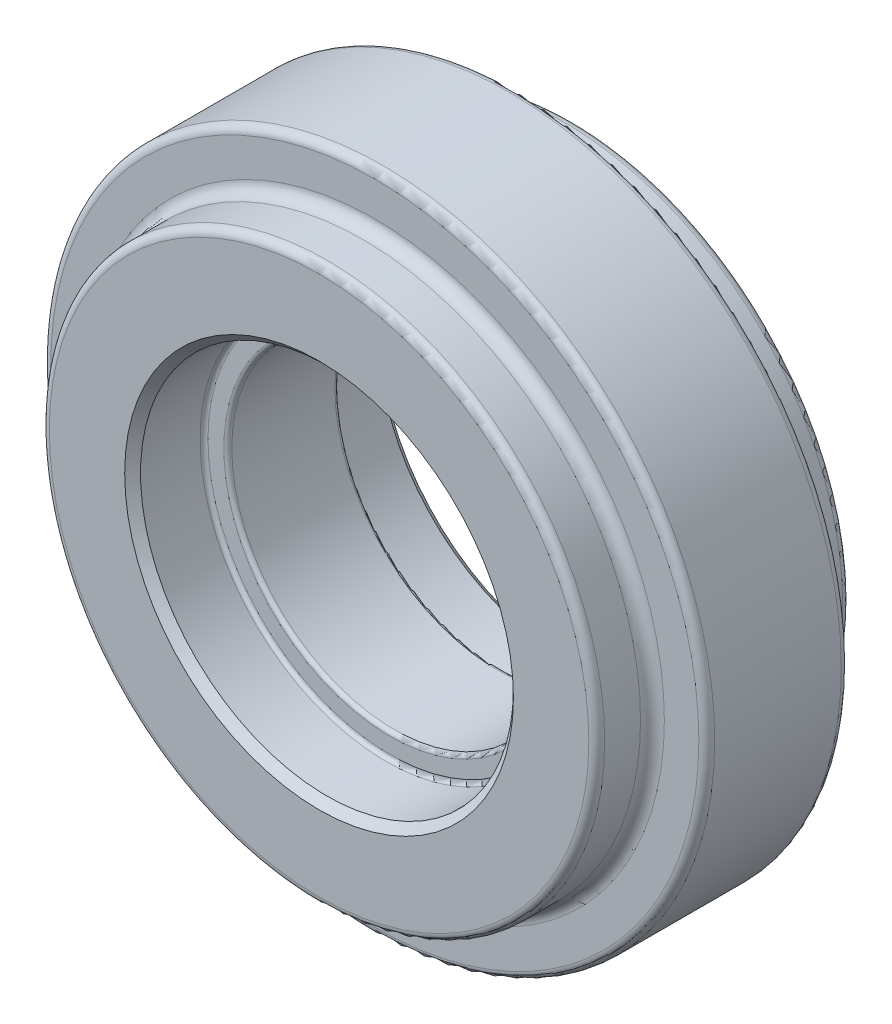
ISO-10303-21;
HEADER;
FILE_DESCRIPTION(('STEP AP214'),'2;1');
FILE_NAME('part.step','',(''),(''),'','','');
FILE_SCHEMA(('AUTOMOTIVE_DESIGN { 1 0 10303 214 1 1 1 1 }'));
ENDSEC;
DATA;
#1=APPLICATION_CONTEXT('core data for automotive mechanical design processes');
#2=APPLICATION_PROTOCOL_DEFINITION('international standard','automotive_design',2000,#1);
#3=PRODUCT_CONTEXT('',#1,'mechanical');
#4=PRODUCT('Part','Part','',(#3));
#5=PRODUCT_RELATED_PRODUCT_CATEGORY('part','',(#4));
#6=PRODUCT_DEFINITION_FORMATION('','',#4);
#7=PRODUCT_DEFINITION_CONTEXT('part definition',#1,'design');
#8=PRODUCT_DEFINITION('design','',#6,#7);
#9=PRODUCT_DEFINITION_SHAPE('','',#8);
#10=(LENGTH_UNIT() NAMED_UNIT(*) SI_UNIT(.MILLI.,.METRE.));
#11=(NAMED_UNIT(*) PLANE_ANGLE_UNIT() SI_UNIT($,.RADIAN.));
#12=(NAMED_UNIT(*) SI_UNIT($,.STERADIAN.) SOLID_ANGLE_UNIT());
#13=UNCERTAINTY_MEASURE_WITH_UNIT(LENGTH_MEASURE(1.E-05),#10,'distance_accuracy_value','');
#14=(GEOMETRIC_REPRESENTATION_CONTEXT(3) GLOBAL_UNCERTAINTY_ASSIGNED_CONTEXT((#13)) GLOBAL_UNIT_ASSIGNED_CONTEXT((#10,
#11,#12)) REPRESENTATION_CONTEXT('',''));
#15=CARTESIAN_POINT('',(0.,0.,0.));
#16=DIRECTION('',(0.,0.,1.));
#17=DIRECTION('',(1.,0.,0.));
#18=AXIS2_PLACEMENT_3D('',#15,#16,#17);
#19=CARTESIAN_POINT('',(0.,0.,17.955));
#20=DIRECTION('',(0.,0.,-1.));
#21=DIRECTION('',(-1.,0.,0.));
#22=AXIS2_PLACEMENT_3D('',#19,#20,#21);
#23=CYLINDRICAL_SURFACE('',#22,41.84762);
#24=CARTESIAN_POINT('',(0.,0.,1.));
#25=DIRECTION('',(0.,0.,1.));
#26=DIRECTION('',(1.,0.,0.));
#27=AXIS2_PLACEMENT_3D('',#24,#25,#26);
#28=CIRCLE('',#27,41.84762);
#29=CARTESIAN_POINT('',(41.84762,0.,1.));
#30=VERTEX_POINT('',#29);
#31=EDGE_CURVE('E88',#30,#30,#28,.T.);
#32=ORIENTED_EDGE('',*,*,#31,.T.);
#33=EDGE_LOOP('',(#32));
#34=FACE_BOUND('',#33,.T.);
#35=CARTESIAN_POINT('',(0.,0.,16.955));
#36=DIRECTION('',(0.,0.,1.));
#37=DIRECTION('',(1.,0.,0.));
#38=AXIS2_PLACEMENT_3D('',#35,#36,#37);
#39=CIRCLE('',#38,41.84762);
#40=CARTESIAN_POINT('',(41.84762,0.,16.955));
#41=VERTEX_POINT('',#40);
#42=EDGE_CURVE('E91',#41,#41,#39,.F.);
#43=ORIENTED_EDGE('',*,*,#42,.T.);
#44=EDGE_LOOP('',(#43));
#45=FACE_BOUND('',#44,.T.);
#46=ADVANCED_FACE('F32',(#34,#45),#23,.T.);
#47=CARTESIAN_POINT('',(0.,0.,17.955));
#48=DIRECTION('',(0.,0.,1.));
#49=DIRECTION('',(1.,0.,0.));
#50=AXIS2_PLACEMENT_3D('',#47,#48,#49);
#51=PLANE('',#50);
#52=CARTESIAN_POINT('',(0.,0.,17.955));
#53=DIRECTION('',(0.,0.,1.));
#54=DIRECTION('',(1.,0.,0.));
#55=AXIS2_PLACEMENT_3D('',#52,#53,#54);
#56=CIRCLE('',#55,40.84762);
#57=CARTESIAN_POINT('',(40.84762,0.,17.955));
#58=VERTEX_POINT('',#57);
#59=EDGE_CURVE('E82',#58,#58,#56,.T.);
#60=ORIENTED_EDGE('',*,*,#59,.T.);
#61=EDGE_LOOP('',(#60));
#62=FACE_BOUND('',#61,.T.);
#63=CARTESIAN_POINT('',(0.,0.,17.955));
#64=DIRECTION('',(0.,0.,1.));
#65=DIRECTION('',(1.,0.,0.));
#66=AXIS2_PLACEMENT_3D('',#63,#64,#65);
#67=CIRCLE('',#66,36.5);
#68=CARTESIAN_POINT('',(36.5,0.,17.955));
#69=VERTEX_POINT('',#68);
#70=EDGE_CURVE('E100',#69,#69,#67,.F.);
#71=ORIENTED_EDGE('',*,*,#70,.T.);
#72=EDGE_LOOP('',(#71));
#73=FACE_BOUND('',#72,.T.);
#74=ADVANCED_FACE('F132',(#62,#73),#51,.T.);
#75=CARTESIAN_POINT('',(0.,0.,0.));
#76=DIRECTION('',(0.,0.,1.));
#77=DIRECTION('',(1.,0.,0.));
#78=AXIS2_PLACEMENT_3D('',#75,#76,#77);
#79=PLANE('',#78);
#80=CARTESIAN_POINT('',(0.,0.,0.));
#81=DIRECTION('',(0.,0.,1.));
#82=DIRECTION('',(1.,0.,0.));
#83=AXIS2_PLACEMENT_3D('',#80,#81,#82);
#84=CIRCLE('',#83,40.84762);
#85=CARTESIAN_POINT('',(40.84762,0.,0.));
#86=VERTEX_POINT('',#85);
#87=EDGE_CURVE('E85',#86,#86,#84,.F.);
#88=ORIENTED_EDGE('',*,*,#87,.T.);
#89=EDGE_LOOP('',(#88));
#90=FACE_BOUND('',#89,.T.);
#91=CARTESIAN_POINT('',(0.,0.,0.));
#92=DIRECTION('',(0.,0.,1.));
#93=DIRECTION('',(1.,0.,0.));
#94=AXIS2_PLACEMENT_3D('',#91,#92,#93);
#95=CIRCLE('',#94,36.5);
#96=CARTESIAN_POINT('',(36.5,0.,0.));
#97=VERTEX_POINT('',#96);
#98=EDGE_CURVE('E106',#97,#97,#95,.T.);
#99=ORIENTED_EDGE('',*,*,#98,.T.);
#100=EDGE_LOOP('',(#99));
#101=FACE_BOUND('',#100,.T.);
#102=ADVANCED_FACE('F137',(#90,#101),#79,.F.);
#103=CARTESIAN_POINT('',(0.,0.,24.9775));
#104=DIRECTION('',(0.,0.,-1.));
#105=DIRECTION('',(-1.,0.,0.));
#106=AXIS2_PLACEMENT_3D('',#103,#104,#105);
#107=CYLINDRICAL_SURFACE('',#106,35.);
#108=CARTESIAN_POINT('',(0.,0.,23.9775));
#109=DIRECTION('',(0.,0.,1.));
#110=DIRECTION('',(1.,0.,0.));
#111=AXIS2_PLACEMENT_3D('',#108,#109,#110);
#112=CIRCLE('',#111,35.);
#113=CARTESIAN_POINT('',(35.,0.,23.9775));
#114=VERTEX_POINT('',#113);
#115=EDGE_CURVE('E76',#114,#114,#112,.F.);
#116=ORIENTED_EDGE('',*,*,#115,.T.);
#117=EDGE_LOOP('',(#116));
#118=FACE_BOUND('',#117,.T.);
#119=CARTESIAN_POINT('',(0.,0.,19.455));
#120=DIRECTION('',(0.,0.,1.));
#121=DIRECTION('',(1.,0.,0.));
#122=AXIS2_PLACEMENT_3D('',#119,#120,#121);
#123=CIRCLE('',#122,35.);
#124=CARTESIAN_POINT('',(35.,0.,19.455));
#125=VERTEX_POINT('',#124);
#126=EDGE_CURVE('E103',#125,#125,#123,.T.);
#127=ORIENTED_EDGE('',*,*,#126,.T.);
#128=EDGE_LOOP('',(#127));
#129=FACE_BOUND('',#128,.T.);
#130=ADVANCED_FACE('F143',(#118,#129),#107,.T.);
#131=CARTESIAN_POINT('',(0.,0.,24.9775));
#132=DIRECTION('',(0.,0.,1.));
#133=DIRECTION('',(1.,0.,0.));
#134=AXIS2_PLACEMENT_3D('',#131,#132,#133);
#135=PLANE('',#134);
#136=CARTESIAN_POINT('',(0.,0.,24.9775));
#137=DIRECTION('',(0.,0.,1.));
#138=DIRECTION('',(1.,0.,0.));
#139=AXIS2_PLACEMENT_3D('',#136,#137,#138);
#140=CIRCLE('',#139,24.5);
#141=CARTESIAN_POINT('',(24.5,0.,24.9775));
#142=VERTEX_POINT('',#141);
#143=EDGE_CURVE('E43',#142,#142,#140,.F.);
#144=ORIENTED_EDGE('',*,*,#143,.T.);
#145=EDGE_LOOP('',(#144));
#146=FACE_BOUND('',#145,.T.);
#147=CARTESIAN_POINT('',(0.,0.,24.9775));
#148=DIRECTION('',(0.,0.,1.));
#149=DIRECTION('',(1.,0.,0.));
#150=AXIS2_PLACEMENT_3D('',#147,#148,#149);
#151=CIRCLE('',#150,34.);
#152=CARTESIAN_POINT('',(34.,0.,24.9775));
#153=VERTEX_POINT('',#152);
#154=EDGE_CURVE('E79',#153,#153,#151,.T.);
#155=ORIENTED_EDGE('',*,*,#154,.T.);
#156=EDGE_LOOP('',(#155));
#157=FACE_BOUND('',#156,.T.);
#158=ADVANCED_FACE('F148',(#146,#157),#135,.T.);
#159=CARTESIAN_POINT('',(0.,0.,-7.0225));
#160=DIRECTION('',(0.,0.,1.));
#161=DIRECTION('',(1.,0.,0.));
#162=AXIS2_PLACEMENT_3D('',#159,#160,#161);
#163=CYLINDRICAL_SURFACE('',#162,35.);
#164=CARTESIAN_POINT('',(0.,0.,-6.0225));
#165=DIRECTION('',(0.,0.,-1.));
#166=DIRECTION('',(-1.,0.,0.));
#167=AXIS2_PLACEMENT_3D('',#164,#165,#166);
#168=CIRCLE('',#167,35.);
#169=CARTESIAN_POINT('',(-35.,0.,-6.0225));
#170=VERTEX_POINT('',#169);
#171=EDGE_CURVE('E94',#170,#170,#168,.F.);
#172=ORIENTED_EDGE('',*,*,#171,.T.);
#173=EDGE_LOOP('',(#172));
#174=FACE_BOUND('',#173,.T.);
#175=CARTESIAN_POINT('',(0.,0.,-1.5));
#176=DIRECTION('',(0.,0.,1.));
#177=DIRECTION('',(1.,0.,0.));
#178=AXIS2_PLACEMENT_3D('',#175,#176,#177);
#179=CIRCLE('',#178,35.);
#180=CARTESIAN_POINT('',(35.,0.,-1.5));
#181=VERTEX_POINT('',#180);
#182=EDGE_CURVE('E109',#181,#181,#179,.F.);
#183=ORIENTED_EDGE('',*,*,#182,.T.);
#184=EDGE_LOOP('',(#183));
#185=FACE_BOUND('',#184,.T.);
#186=ADVANCED_FACE('F113',(#174,#185),#163,.T.);
#187=CARTESIAN_POINT('',(0.,0.,-7.0225));
#188=DIRECTION('',(0.,0.,-1.));
#189=DIRECTION('',(-1.,0.,0.));
#190=AXIS2_PLACEMENT_3D('',#187,#188,#189);
#191=PLANE('',#190);
#192=CARTESIAN_POINT('',(0.,0.,-7.0225));
#193=DIRECTION('',(0.,0.,-1.));
#194=DIRECTION('',(-1.,0.,0.));
#195=AXIS2_PLACEMENT_3D('',#192,#193,#194);
#196=CIRCLE('',#195,24.5);
#197=CARTESIAN_POINT('',(-24.5,0.,-7.0225));
#198=VERTEX_POINT('',#197);
#199=EDGE_CURVE('E10',#198,#198,#196,.F.);
#200=ORIENTED_EDGE('',*,*,#199,.T.);
#201=EDGE_LOOP('',(#200));
#202=FACE_BOUND('',#201,.T.);
#203=CARTESIAN_POINT('',(0.,0.,-7.0225));
#204=DIRECTION('',(0.,0.,-1.));
#205=DIRECTION('',(-1.,0.,0.));
#206=AXIS2_PLACEMENT_3D('',#203,#204,#205);
#207=CIRCLE('',#206,34.);
#208=CARTESIAN_POINT('',(-34.,0.,-7.0225));
#209=VERTEX_POINT('',#208);
#210=EDGE_CURVE('E97',#209,#209,#207,.T.);
#211=ORIENTED_EDGE('',*,*,#210,.T.);
#212=EDGE_LOOP('',(#211));
#213=FACE_BOUND('',#212,.T.);
#214=ADVANCED_FACE('F118',(#202,#213),#191,.T.);
#215=CARTESIAN_POINT('',(0.,0.,-1.5));
#216=DIRECTION('',(0.,0.,1.));
#217=DIRECTION('',(1.,0.,0.));
#218=AXIS2_PLACEMENT_3D('',#215,#216,#217);
#219=TOROIDAL_SURFACE('',#218,36.5,1.5);
#220=ORIENTED_EDGE('',*,*,#98,.F.);
#221=EDGE_LOOP('',(#220));
#222=FACE_BOUND('',#221,.T.);
#223=ORIENTED_EDGE('',*,*,#182,.F.);
#224=EDGE_LOOP('',(#223));
#225=FACE_BOUND('',#224,.T.);
#226=ADVANCED_FACE('F115',(#222,#225),#219,.F.);
#227=CARTESIAN_POINT('',(0.,0.,19.455));
#228=DIRECTION('',(0.,0.,1.));
#229=DIRECTION('',(1.,0.,0.));
#230=AXIS2_PLACEMENT_3D('',#227,#228,#229);
#231=TOROIDAL_SURFACE('',#230,36.5,1.5);
#232=ORIENTED_EDGE('',*,*,#70,.F.);
#233=EDGE_LOOP('',(#232));
#234=FACE_BOUND('',#233,.T.);
#235=ORIENTED_EDGE('',*,*,#126,.F.);
#236=EDGE_LOOP('',(#235));
#237=FACE_BOUND('',#236,.T.);
#238=ADVANCED_FACE('F117',(#234,#237),#231,.F.);
#239=CARTESIAN_POINT('',(0.,0.,-6.0225));
#240=DIRECTION('',(0.,0.,-1.));
#241=DIRECTION('',(-1.,0.,0.));
#242=AXIS2_PLACEMENT_3D('',#239,#240,#241);
#243=TOROIDAL_SURFACE('',#242,34.,1.);
#244=ORIENTED_EDGE('',*,*,#171,.F.);
#245=EDGE_LOOP('',(#244));
#246=FACE_BOUND('',#245,.T.);
#247=ORIENTED_EDGE('',*,*,#210,.F.);
#248=EDGE_LOOP('',(#247));
#249=FACE_BOUND('',#248,.T.);
#250=ADVANCED_FACE('F125',(#246,#249),#243,.T.);
#251=CARTESIAN_POINT('',(0.,0.,1.));
#252=DIRECTION('',(0.,0.,1.));
#253=DIRECTION('',(1.,0.,0.));
#254=AXIS2_PLACEMENT_3D('',#251,#252,#253);
#255=TOROIDAL_SURFACE('',#254,40.84762,1.);
#256=ORIENTED_EDGE('',*,*,#87,.F.);
#257=EDGE_LOOP('',(#256));
#258=FACE_BOUND('',#257,.T.);
#259=ORIENTED_EDGE('',*,*,#31,.F.);
#260=EDGE_LOOP('',(#259));
#261=FACE_BOUND('',#260,.T.);
#262=ADVANCED_FACE('F214',(#258,#261),#255,.T.);
#263=CARTESIAN_POINT('',(0.,0.,16.955));
#264=DIRECTION('',(0.,0.,1.));
#265=DIRECTION('',(1.,0.,0.));
#266=AXIS2_PLACEMENT_3D('',#263,#264,#265);
#267=TOROIDAL_SURFACE('',#266,40.84762,1.);
#268=ORIENTED_EDGE('',*,*,#42,.F.);
#269=EDGE_LOOP('',(#268));
#270=FACE_BOUND('',#269,.T.);
#271=ORIENTED_EDGE('',*,*,#59,.F.);
#272=EDGE_LOOP('',(#271));
#273=FACE_BOUND('',#272,.T.);
#274=ADVANCED_FACE('F210',(#270,#273),#267,.T.);
#275=CARTESIAN_POINT('',(0.,0.,23.9775));
#276=DIRECTION('',(0.,0.,1.));
#277=DIRECTION('',(1.,0.,0.));
#278=AXIS2_PLACEMENT_3D('',#275,#276,#277);
#279=TOROIDAL_SURFACE('',#278,34.,1.);
#280=ORIENTED_EDGE('',*,*,#115,.F.);
#281=EDGE_LOOP('',(#280));
#282=FACE_BOUND('',#281,.T.);
#283=ORIENTED_EDGE('',*,*,#154,.F.);
#284=EDGE_LOOP('',(#283));
#285=FACE_BOUND('',#284,.T.);
#286=ADVANCED_FACE('F160',(#282,#285),#279,.T.);
#287=CARTESIAN_POINT('',(0.,0.,15.9775));
#288=DIRECTION('',(0.,0.,1.));
#289=DIRECTION('',(1.,0.,0.));
#290=AXIS2_PLACEMENT_3D('',#287,#288,#289);
#291=CYLINDRICAL_SURFACE('',#290,23.5);
#292=CARTESIAN_POINT('',(0.,0.,23.9775));
#293=DIRECTION('',(0.,0.,1.));
#294=DIRECTION('',(1.,0.,0.));
#295=AXIS2_PLACEMENT_3D('',#292,#293,#294);
#296=CIRCLE('',#295,23.5);
#297=CARTESIAN_POINT('',(23.5,0.,23.9775));
#298=VERTEX_POINT('',#297);
#299=EDGE_CURVE('E47',#298,#298,#296,.T.);
#300=ORIENTED_EDGE('',*,*,#299,.T.);
#301=EDGE_LOOP('',(#300));
#302=FACE_BOUND('',#301,.T.);
#303=CARTESIAN_POINT('',(0.,0.,16.4775));
#304=DIRECTION('',(0.,0.,1.));
#305=DIRECTION('',(1.,0.,0.));
#306=AXIS2_PLACEMENT_3D('',#303,#304,#305);
#307=CIRCLE('',#306,23.5);
#308=CARTESIAN_POINT('',(23.5,0.,16.4775));
#309=VERTEX_POINT('',#308);
#310=EDGE_CURVE('E52',#309,#309,#307,.F.);
#311=ORIENTED_EDGE('',*,*,#310,.T.);
#312=EDGE_LOOP('',(#311));
#313=FACE_BOUND('',#312,.T.);
#314=ADVANCED_FACE('F156',(#302,#313),#291,.F.);
#315=CARTESIAN_POINT('',(0.,0.,15.9775));
#316=DIRECTION('',(0.,0.,1.));
#317=DIRECTION('',(1.,0.,0.));
#318=AXIS2_PLACEMENT_3D('',#315,#316,#317);
#319=PLANE('',#318);
#320=CARTESIAN_POINT('',(0.,0.,15.9775));
#321=DIRECTION('',(0.,0.,1.));
#322=DIRECTION('',(1.,0.,0.));
#323=AXIS2_PLACEMENT_3D('',#320,#321,#322);
#324=CIRCLE('',#323,21.);
#325=CARTESIAN_POINT('',(21.,0.,15.9775));
#326=VERTEX_POINT('',#325);
#327=EDGE_CURVE('E55',#326,#326,#324,.F.);
#328=ORIENTED_EDGE('',*,*,#327,.T.);
#329=EDGE_LOOP('',(#328));
#330=FACE_BOUND('',#329,.T.);
#331=CARTESIAN_POINT('',(0.,0.,15.9775));
#332=DIRECTION('',(0.,0.,1.));
#333=DIRECTION('',(1.,0.,0.));
#334=AXIS2_PLACEMENT_3D('',#331,#332,#333);
#335=CIRCLE('',#334,23.);
#336=CARTESIAN_POINT('',(23.,0.,15.9775));
#337=VERTEX_POINT('',#336);
#338=EDGE_CURVE('E58',#337,#337,#335,.T.);
#339=ORIENTED_EDGE('',*,*,#338,.T.);
#340=EDGE_LOOP('',(#339));
#341=FACE_BOUND('',#340,.T.);
#342=ADVANCED_FACE('F159',(#330,#341),#319,.T.);
#343=CARTESIAN_POINT('',(0.,0.,1.9775));
#344=DIRECTION('',(0.,0.,-1.));
#345=DIRECTION('',(-1.,0.,0.));
#346=AXIS2_PLACEMENT_3D('',#343,#344,#345);
#347=CYLINDRICAL_SURFACE('',#346,23.5);
#348=CARTESIAN_POINT('',(0.,0.,-6.0225));
#349=DIRECTION('',(0.,0.,-1.));
#350=DIRECTION('',(-1.,0.,0.));
#351=AXIS2_PLACEMENT_3D('',#348,#349,#350);
#352=CIRCLE('',#351,23.5);
#353=CARTESIAN_POINT('',(-23.5,0.,-6.0225));
#354=VERTEX_POINT('',#353);
#355=EDGE_CURVE('E39',#354,#354,#352,.T.);
#356=ORIENTED_EDGE('',*,*,#355,.T.);
#357=EDGE_LOOP('',(#356));
#358=FACE_BOUND('',#357,.T.);
#359=CARTESIAN_POINT('',(0.,0.,1.4775));
#360=DIRECTION('',(0.,0.,-1.));
#361=DIRECTION('',(-1.,0.,0.));
#362=AXIS2_PLACEMENT_3D('',#359,#360,#361);
#363=CIRCLE('',#362,23.5);
#364=CARTESIAN_POINT('',(-23.5,0.,1.4775));
#365=VERTEX_POINT('',#364);
#366=EDGE_CURVE('E67',#365,#365,#363,.F.);
#367=ORIENTED_EDGE('',*,*,#366,.T.);
#368=EDGE_LOOP('',(#367));
#369=FACE_BOUND('',#368,.T.);
#370=ADVANCED_FACE('F164',(#358,#369),#347,.F.);
#371=CARTESIAN_POINT('',(0.,0.,1.9775));
#372=DIRECTION('',(0.,0.,-1.));
#373=DIRECTION('',(-1.,0.,0.));
#374=AXIS2_PLACEMENT_3D('',#371,#372,#373);
#375=PLANE('',#374);
#376=CARTESIAN_POINT('',(0.,0.,1.9775));
#377=DIRECTION('',(0.,0.,-1.));
#378=DIRECTION('',(-1.,0.,0.));
#379=AXIS2_PLACEMENT_3D('',#376,#377,#378);
#380=CIRCLE('',#379,23.);
#381=CARTESIAN_POINT('',(-23.,0.,1.9775));
#382=VERTEX_POINT('',#381);
#383=EDGE_CURVE('E70',#382,#382,#380,.T.);
#384=ORIENTED_EDGE('',*,*,#383,.T.);
#385=EDGE_LOOP('',(#384));
#386=FACE_BOUND('',#385,.T.);
#387=CARTESIAN_POINT('',(0.,0.,1.9775));
#388=DIRECTION('',(0.,0.,-1.));
#389=DIRECTION('',(-1.,0.,0.));
#390=AXIS2_PLACEMENT_3D('',#387,#388,#389);
#391=CIRCLE('',#390,21.);
#392=CARTESIAN_POINT('',(-21.,0.,1.9775));
#393=VERTEX_POINT('',#392);
#394=EDGE_CURVE('E73',#393,#393,#391,.F.);
#395=ORIENTED_EDGE('',*,*,#394,.T.);
#396=EDGE_LOOP('',(#395));
#397=FACE_BOUND('',#396,.T.);
#398=ADVANCED_FACE('F168',(#386,#397),#375,.T.);
#399=CARTESIAN_POINT('',(0.,0.,24.9785));
#400=DIRECTION('',(0.,0.,-1.));
#401=DIRECTION('',(-1.,0.,0.));
#402=AXIS2_PLACEMENT_3D('',#399,#400,#401);
#403=CYLINDRICAL_SURFACE('',#402,20.5);
#404=CARTESIAN_POINT('',(0.,0.,2.4775));
#405=DIRECTION('',(0.,0.,-1.));
#406=DIRECTION('',(-1.,0.,0.));
#407=AXIS2_PLACEMENT_3D('',#404,#405,#406);
#408=CIRCLE('',#407,20.5);
#409=CARTESIAN_POINT('',(-20.5,0.,2.4775));
#410=VERTEX_POINT('',#409);
#411=EDGE_CURVE('E61',#410,#410,#408,.T.);
#412=ORIENTED_EDGE('',*,*,#411,.T.);
#413=EDGE_LOOP('',(#412));
#414=FACE_BOUND('',#413,.T.);
#415=CARTESIAN_POINT('',(0.,0.,15.4775));
#416=DIRECTION('',(0.,0.,1.));
#417=DIRECTION('',(1.,0.,0.));
#418=AXIS2_PLACEMENT_3D('',#415,#416,#417);
#419=CIRCLE('',#418,20.5);
#420=CARTESIAN_POINT('',(20.5,0.,15.4775));
#421=VERTEX_POINT('',#420);
#422=EDGE_CURVE('E64',#421,#421,#419,.T.);
#423=ORIENTED_EDGE('',*,*,#422,.T.);
#424=EDGE_LOOP('',(#423));
#425=FACE_BOUND('',#424,.T.);
#426=ADVANCED_FACE('F171',(#414,#425),#403,.F.);
#427=CARTESIAN_POINT('',(0.,0.,1.4775));
#428=DIRECTION('',(0.,0.,-1.));
#429=DIRECTION('',(-1.,0.,0.));
#430=AXIS2_PLACEMENT_3D('',#427,#428,#429);
#431=TOROIDAL_SURFACE('',#430,23.,0.5);
#432=ORIENTED_EDGE('',*,*,#366,.F.);
#433=EDGE_LOOP('',(#432));
#434=FACE_BOUND('',#433,.T.);
#435=ORIENTED_EDGE('',*,*,#383,.F.);
#436=EDGE_LOOP('',(#435));
#437=FACE_BOUND('',#436,.T.);
#438=ADVANCED_FACE('F174',(#434,#437),#431,.F.);
#439=CARTESIAN_POINT('',(0.,0.,2.4775));
#440=DIRECTION('',(0.,0.,-1.));
#441=DIRECTION('',(-1.,0.,0.));
#442=AXIS2_PLACEMENT_3D('',#439,#440,#441);
#443=TOROIDAL_SURFACE('',#442,21.,0.5);
#444=ORIENTED_EDGE('',*,*,#394,.F.);
#445=EDGE_LOOP('',(#444));
#446=FACE_BOUND('',#445,.T.);
#447=ORIENTED_EDGE('',*,*,#411,.F.);
#448=EDGE_LOOP('',(#447));
#449=FACE_BOUND('',#448,.T.);
#450=ADVANCED_FACE('F179',(#446,#449),#443,.T.);
#451=CARTESIAN_POINT('',(0.,0.,15.4775));
#452=DIRECTION('',(0.,0.,1.));
#453=DIRECTION('',(1.,0.,0.));
#454=AXIS2_PLACEMENT_3D('',#451,#452,#453);
#455=TOROIDAL_SURFACE('',#454,21.,0.5);
#456=ORIENTED_EDGE('',*,*,#422,.F.);
#457=EDGE_LOOP('',(#456));
#458=FACE_BOUND('',#457,.T.);
#459=ORIENTED_EDGE('',*,*,#327,.F.);
#460=EDGE_LOOP('',(#459));
#461=FACE_BOUND('',#460,.T.);
#462=ADVANCED_FACE('F186',(#458,#461),#455,.T.);
#463=CARTESIAN_POINT('',(0.,0.,16.4775));
#464=DIRECTION('',(0.,0.,1.));
#465=DIRECTION('',(1.,0.,0.));
#466=AXIS2_PLACEMENT_3D('',#463,#464,#465);
#467=TOROIDAL_SURFACE('',#466,23.,0.5);
#468=ORIENTED_EDGE('',*,*,#310,.F.);
#469=EDGE_LOOP('',(#468));
#470=FACE_BOUND('',#469,.T.);
#471=ORIENTED_EDGE('',*,*,#338,.F.);
#472=EDGE_LOOP('',(#471));
#473=FACE_BOUND('',#472,.T.);
#474=ADVANCED_FACE('F189',(#470,#473),#467,.F.);
#475=CARTESIAN_POINT('',(0.,0.,23.9775));
#476=DIRECTION('',(0.,0.,1.));
#477=DIRECTION('',(1.,0.,0.));
#478=AXIS2_PLACEMENT_3D('',#475,#476,#477);
#479=CONICAL_SURFACE('',#478,23.5,0.785398163397441);
#480=ORIENTED_EDGE('',*,*,#143,.F.);
#481=EDGE_LOOP('',(#480));
#482=FACE_BOUND('',#481,.T.);
#483=ORIENTED_EDGE('',*,*,#299,.F.);
#484=EDGE_LOOP('',(#483));
#485=FACE_BOUND('',#484,.T.);
#486=ADVANCED_FACE('F196',(#482,#485),#479,.F.);
#487=CARTESIAN_POINT('',(0.,0.,-6.0225));
#488=DIRECTION('',(0.,0.,-1.));
#489=DIRECTION('',(-1.,0.,0.));
#490=AXIS2_PLACEMENT_3D('',#487,#488,#489);
#491=CONICAL_SURFACE('',#490,23.5,0.785398163397448);
#492=ORIENTED_EDGE('',*,*,#199,.F.);
#493=EDGE_LOOP('',(#492));
#494=FACE_BOUND('',#493,.T.);
#495=ORIENTED_EDGE('',*,*,#355,.F.);
#496=EDGE_LOOP('',(#495));
#497=FACE_BOUND('',#496,.T.);
#498=ADVANCED_FACE('F34',(#494,#497),#491,.F.);
#499=CLOSED_SHELL('',(#46,#74,#102,#130,#158,#186,#214,#226,#238,#250,#262,#274,#286,#314,#342,
#370,#398,#426,#438,#450,#462,#474,#486,#498));
#500=MANIFOLD_SOLID_BREP('B2',#499);
#501=ADVANCED_BREP_SHAPE_REPRESENTATION('',(#18,#500),#14);
#502=SHAPE_DEFINITION_REPRESENTATION(#9,#501);
ENDSEC;
END-ISO-10303-21;
